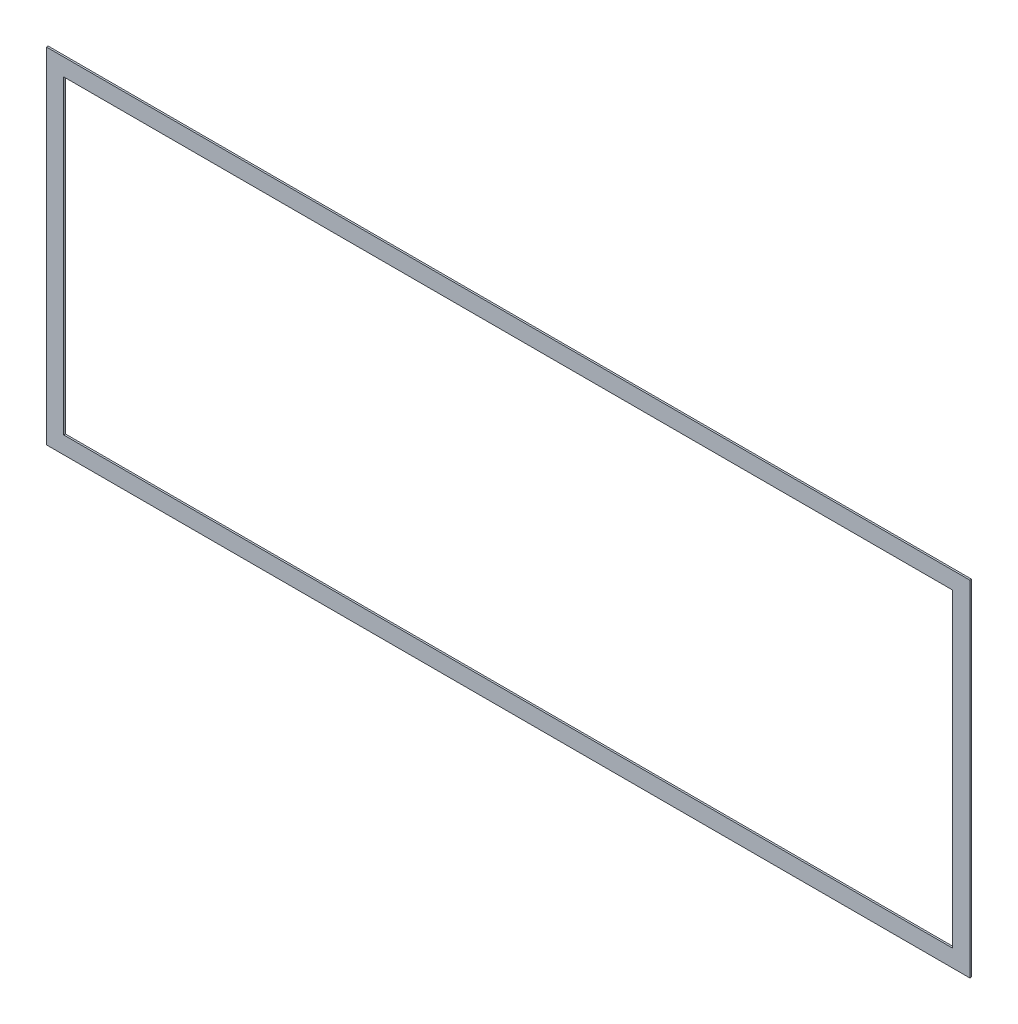
ISO-10303-21;
HEADER;
FILE_DESCRIPTION(('STEP AP214'),'2;1');
FILE_NAME('part.step','',(''),(''),'','','');
FILE_SCHEMA(('AUTOMOTIVE_DESIGN { 1 0 10303 214 1 1 1 1 }'));
ENDSEC;
DATA;
#1=APPLICATION_CONTEXT('core data for automotive mechanical design processes');
#2=APPLICATION_PROTOCOL_DEFINITION('international standard','automotive_design',2000,#1);
#3=PRODUCT_CONTEXT('',#1,'mechanical');
#4=PRODUCT('Part','Part','',(#3));
#5=PRODUCT_RELATED_PRODUCT_CATEGORY('part','',(#4));
#6=PRODUCT_DEFINITION_FORMATION('','',#4);
#7=PRODUCT_DEFINITION_CONTEXT('part definition',#1,'design');
#8=PRODUCT_DEFINITION('design','',#6,#7);
#9=PRODUCT_DEFINITION_SHAPE('','',#8);
#10=(LENGTH_UNIT() NAMED_UNIT(*) SI_UNIT(.MILLI.,.METRE.));
#11=(NAMED_UNIT(*) PLANE_ANGLE_UNIT() SI_UNIT($,.RADIAN.));
#12=(NAMED_UNIT(*) SI_UNIT($,.STERADIAN.) SOLID_ANGLE_UNIT());
#13=UNCERTAINTY_MEASURE_WITH_UNIT(LENGTH_MEASURE(1.E-05),#10,'distance_accuracy_value','');
#14=(GEOMETRIC_REPRESENTATION_CONTEXT(3) GLOBAL_UNCERTAINTY_ASSIGNED_CONTEXT((#13)) GLOBAL_UNIT_ASSIGNED_CONTEXT((#10,
#11,#12)) REPRESENTATION_CONTEXT('',''));
#15=CARTESIAN_POINT('',(0.,0.,0.));
#16=DIRECTION('',(0.,0.,1.));
#17=DIRECTION('',(1.,0.,0.));
#18=AXIS2_PLACEMENT_3D('',#15,#16,#17);
#19=CARTESIAN_POINT('',(0.,0.,0.));
#20=DIRECTION('',(0.,0.,1.));
#21=DIRECTION('',(1.,0.,0.));
#22=AXIS2_PLACEMENT_3D('',#19,#20,#21);
#23=PLANE('',#22);
#24=DIRECTION('',(0.,-1.,0.));
#25=VECTOR('',#24,1.);
#26=CARTESIAN_POINT('',(129.,45.,0.));
#27=LINE('',#26,#25);
#28=CARTESIAN_POINT('',(129.,45.,0.));
#29=VERTEX_POINT('',#28);
#30=CARTESIAN_POINT('',(129.,-45.,0.));
#31=VERTEX_POINT('',#30);
#32=EDGE_CURVE('E80',#29,#31,#27,.T.);
#33=ORIENTED_EDGE('',*,*,#32,.F.);
#34=DIRECTION('',(1.,0.,0.));
#35=VECTOR('',#34,1.);
#36=CARTESIAN_POINT('',(-129.,45.,0.));
#37=LINE('',#36,#35);
#38=CARTESIAN_POINT('',(-129.,45.,0.));
#39=VERTEX_POINT('',#38);
#40=EDGE_CURVE('E141',#39,#29,#37,.T.);
#41=ORIENTED_EDGE('',*,*,#40,.F.);
#42=DIRECTION('',(0.,1.,0.));
#43=VECTOR('',#42,1.);
#44=CARTESIAN_POINT('',(-129.,-45.,0.));
#45=LINE('',#44,#43);
#46=CARTESIAN_POINT('',(-129.,-45.,0.));
#47=VERTEX_POINT('',#46);
#48=EDGE_CURVE('E149',#47,#39,#45,.T.);
#49=ORIENTED_EDGE('',*,*,#48,.F.);
#50=DIRECTION('',(-1.,0.,0.));
#51=VECTOR('',#50,1.);
#52=CARTESIAN_POINT('',(129.,-45.,0.));
#53=LINE('',#52,#51);
#54=EDGE_CURVE('E129',#31,#47,#53,.T.);
#55=ORIENTED_EDGE('',*,*,#54,.F.);
#56=EDGE_LOOP('',(#33,#41,#49,#55));
#57=FACE_BOUND('',#56,.T.);
#58=DIRECTION('',(0.,1.,0.));
#59=VECTOR('',#58,1.);
#60=CARTESIAN_POINT('',(134.,-50.,0.));
#61=LINE('',#60,#59);
#62=CARTESIAN_POINT('',(134.,-50.,0.));
#63=VERTEX_POINT('',#62);
#64=CARTESIAN_POINT('',(134.,50.,0.));
#65=VERTEX_POINT('',#64);
#66=EDGE_CURVE('E27',#63,#65,#61,.T.);
#67=ORIENTED_EDGE('',*,*,#66,.F.);
#68=DIRECTION('',(1.,0.,0.));
#69=VECTOR('',#68,1.);
#70=CARTESIAN_POINT('',(-134.,-50.,0.));
#71=LINE('',#70,#69);
#72=CARTESIAN_POINT('',(-134.,-50.,0.));
#73=VERTEX_POINT('',#72);
#74=EDGE_CURVE('E118',#73,#63,#71,.T.);
#75=ORIENTED_EDGE('',*,*,#74,.F.);
#76=DIRECTION('',(0.,-1.,0.));
#77=VECTOR('',#76,1.);
#78=CARTESIAN_POINT('',(-134.,50.,0.));
#79=LINE('',#78,#77);
#80=CARTESIAN_POINT('',(-134.,50.,0.));
#81=VERTEX_POINT('',#80);
#82=EDGE_CURVE('E162',#81,#73,#79,.T.);
#83=ORIENTED_EDGE('',*,*,#82,.F.);
#84=DIRECTION('',(-1.,0.,0.));
#85=VECTOR('',#84,1.);
#86=CARTESIAN_POINT('',(134.,50.,0.));
#87=LINE('',#86,#85);
#88=EDGE_CURVE('E166',#65,#81,#87,.T.);
#89=ORIENTED_EDGE('',*,*,#88,.F.);
#90=EDGE_LOOP('',(#67,#75,#83,#89));
#91=FACE_BOUND('',#90,.T.);
#92=ADVANCED_FACE('F16',(#57,#91),#23,.F.);
#93=CARTESIAN_POINT('',(0.,0.,0.5));
#94=DIRECTION('',(0.,0.,1.));
#95=DIRECTION('',(1.,0.,0.));
#96=AXIS2_PLACEMENT_3D('',#93,#94,#95);
#97=PLANE('',#96);
#98=DIRECTION('',(0.,-1.,0.));
#99=VECTOR('',#98,1.);
#100=CARTESIAN_POINT('',(129.,45.,0.5));
#101=LINE('',#100,#99);
#102=CARTESIAN_POINT('',(129.,45.,0.5));
#103=VERTEX_POINT('',#102);
#104=CARTESIAN_POINT('',(129.,-45.,0.5));
#105=VERTEX_POINT('',#104);
#106=EDGE_CURVE('E20',#103,#105,#101,.T.);
#107=ORIENTED_EDGE('',*,*,#106,.T.);
#108=DIRECTION('',(-1.,0.,0.));
#109=VECTOR('',#108,1.);
#110=CARTESIAN_POINT('',(129.,-45.,0.5));
#111=LINE('',#110,#109);
#112=CARTESIAN_POINT('',(-129.,-45.,0.5));
#113=VERTEX_POINT('',#112);
#114=EDGE_CURVE('E112',#105,#113,#111,.T.);
#115=ORIENTED_EDGE('',*,*,#114,.T.);
#116=DIRECTION('',(0.,1.,0.));
#117=VECTOR('',#116,1.);
#118=CARTESIAN_POINT('',(-129.,-45.,0.5));
#119=LINE('',#118,#117);
#120=CARTESIAN_POINT('',(-129.,45.,0.5));
#121=VERTEX_POINT('',#120);
#122=EDGE_CURVE('E57',#113,#121,#119,.T.);
#123=ORIENTED_EDGE('',*,*,#122,.T.);
#124=DIRECTION('',(1.,0.,0.));
#125=VECTOR('',#124,1.);
#126=CARTESIAN_POINT('',(-129.,45.,0.5));
#127=LINE('',#126,#125);
#128=EDGE_CURVE('E115',#121,#103,#127,.T.);
#129=ORIENTED_EDGE('',*,*,#128,.T.);
#130=EDGE_LOOP('',(#107,#115,#123,#129));
#131=FACE_BOUND('',#130,.T.);
#132=DIRECTION('',(0.,1.,0.));
#133=VECTOR('',#132,1.);
#134=CARTESIAN_POINT('',(134.,-50.,0.5));
#135=LINE('',#134,#133);
#136=CARTESIAN_POINT('',(134.,-50.,0.5));
#137=VERTEX_POINT('',#136);
#138=CARTESIAN_POINT('',(134.,50.,0.5));
#139=VERTEX_POINT('',#138);
#140=EDGE_CURVE('E11',#137,#139,#135,.T.);
#141=ORIENTED_EDGE('',*,*,#140,.T.);
#142=DIRECTION('',(-1.,0.,0.));
#143=VECTOR('',#142,1.);
#144=CARTESIAN_POINT('',(134.,50.,0.5));
#145=LINE('',#144,#143);
#146=CARTESIAN_POINT('',(-134.,50.,0.5));
#147=VERTEX_POINT('',#146);
#148=EDGE_CURVE('E169',#139,#147,#145,.T.);
#149=ORIENTED_EDGE('',*,*,#148,.T.);
#150=DIRECTION('',(0.,-1.,0.));
#151=VECTOR('',#150,1.);
#152=CARTESIAN_POINT('',(-134.,50.,0.5));
#153=LINE('',#152,#151);
#154=CARTESIAN_POINT('',(-134.,-50.,0.5));
#155=VERTEX_POINT('',#154);
#156=EDGE_CURVE('E158',#147,#155,#153,.T.);
#157=ORIENTED_EDGE('',*,*,#156,.T.);
#158=DIRECTION('',(1.,0.,0.));
#159=VECTOR('',#158,1.);
#160=CARTESIAN_POINT('',(-134.,-50.,0.5));
#161=LINE('',#160,#159);
#162=EDGE_CURVE('E140',#155,#137,#161,.T.);
#163=ORIENTED_EDGE('',*,*,#162,.T.);
#164=EDGE_LOOP('',(#141,#149,#157,#163));
#165=FACE_BOUND('',#164,.T.);
#166=ADVANCED_FACE('F110',(#131,#165),#97,.T.);
#167=CARTESIAN_POINT('',(134.,-50.,0.));
#168=DIRECTION('',(1.,0.,0.));
#169=DIRECTION('',(0.,1.,0.));
#170=AXIS2_PLACEMENT_3D('',#167,#168,#169);
#171=PLANE('',#170);
#172=ORIENTED_EDGE('',*,*,#66,.T.);
#173=DIRECTION('',(0.,0.,1.));
#174=VECTOR('',#173,1.);
#175=CARTESIAN_POINT('',(134.,50.,0.));
#176=LINE('',#175,#174);
#177=EDGE_CURVE('E154',#65,#139,#176,.T.);
#178=ORIENTED_EDGE('',*,*,#177,.T.);
#179=ORIENTED_EDGE('',*,*,#140,.F.);
#180=DIRECTION('',(0.,0.,1.));
#181=VECTOR('',#180,1.);
#182=CARTESIAN_POINT('',(134.,-50.,0.));
#183=LINE('',#182,#181);
#184=EDGE_CURVE('E137',#63,#137,#183,.T.);
#185=ORIENTED_EDGE('',*,*,#184,.F.);
#186=EDGE_LOOP('',(#172,#178,#179,#185));
#187=FACE_BOUND('',#186,.T.);
#188=ADVANCED_FACE('F213',(#187),#171,.T.);
#189=CARTESIAN_POINT('',(134.,50.,0.));
#190=DIRECTION('',(0.,1.,0.));
#191=DIRECTION('',(1.,0.,0.));
#192=AXIS2_PLACEMENT_3D('',#189,#190,#191);
#193=PLANE('',#192);
#194=ORIENTED_EDGE('',*,*,#88,.T.);
#195=DIRECTION('',(0.,0.,1.));
#196=VECTOR('',#195,1.);
#197=CARTESIAN_POINT('',(-134.,50.,0.));
#198=LINE('',#197,#196);
#199=EDGE_CURVE('E161',#81,#147,#198,.T.);
#200=ORIENTED_EDGE('',*,*,#199,.T.);
#201=ORIENTED_EDGE('',*,*,#148,.F.);
#202=ORIENTED_EDGE('',*,*,#177,.F.);
#203=EDGE_LOOP('',(#194,#200,#201,#202));
#204=FACE_BOUND('',#203,.T.);
#205=ADVANCED_FACE('F203',(#204),#193,.T.);
#206=CARTESIAN_POINT('',(-134.,50.,0.));
#207=DIRECTION('',(-1.,0.,0.));
#208=DIRECTION('',(0.,0.,1.));
#209=AXIS2_PLACEMENT_3D('',#206,#207,#208);
#210=PLANE('',#209);
#211=ORIENTED_EDGE('',*,*,#82,.T.);
#212=DIRECTION('',(0.,0.,1.));
#213=VECTOR('',#212,1.);
#214=CARTESIAN_POINT('',(-134.,-50.,0.));
#215=LINE('',#214,#213);
#216=EDGE_CURVE('E174',#73,#155,#215,.T.);
#217=ORIENTED_EDGE('',*,*,#216,.T.);
#218=ORIENTED_EDGE('',*,*,#156,.F.);
#219=ORIENTED_EDGE('',*,*,#199,.F.);
#220=EDGE_LOOP('',(#211,#217,#218,#219));
#221=FACE_BOUND('',#220,.T.);
#222=ADVANCED_FACE('F18',(#221),#210,.T.);
#223=CARTESIAN_POINT('',(-134.,-50.,0.));
#224=DIRECTION('',(0.,-1.,0.));
#225=DIRECTION('',(0.,0.,-1.));
#226=AXIS2_PLACEMENT_3D('',#223,#224,#225);
#227=PLANE('',#226);
#228=ORIENTED_EDGE('',*,*,#74,.T.);
#229=ORIENTED_EDGE('',*,*,#184,.T.);
#230=ORIENTED_EDGE('',*,*,#162,.F.);
#231=ORIENTED_EDGE('',*,*,#216,.F.);
#232=EDGE_LOOP('',(#228,#229,#230,#231));
#233=FACE_BOUND('',#232,.T.);
#234=ADVANCED_FACE('F210',(#233),#227,.T.);
#235=CARTESIAN_POINT('',(129.,45.,0.));
#236=DIRECTION('',(-1.,0.,0.));
#237=DIRECTION('',(0.,0.,1.));
#238=AXIS2_PLACEMENT_3D('',#235,#236,#237);
#239=PLANE('',#238);
#240=ORIENTED_EDGE('',*,*,#32,.T.);
#241=DIRECTION('',(0.,0.,1.));
#242=VECTOR('',#241,1.);
#243=CARTESIAN_POINT('',(129.,-45.,0.));
#244=LINE('',#243,#242);
#245=EDGE_CURVE('E120',#31,#105,#244,.T.);
#246=ORIENTED_EDGE('',*,*,#245,.T.);
#247=ORIENTED_EDGE('',*,*,#106,.F.);
#248=DIRECTION('',(0.,0.,1.));
#249=VECTOR('',#248,1.);
#250=CARTESIAN_POINT('',(129.,45.,0.));
#251=LINE('',#250,#249);
#252=EDGE_CURVE('E145',#29,#103,#251,.T.);
#253=ORIENTED_EDGE('',*,*,#252,.F.);
#254=EDGE_LOOP('',(#240,#246,#247,#253));
#255=FACE_BOUND('',#254,.T.);
#256=ADVANCED_FACE('F121',(#255),#239,.T.);
#257=CARTESIAN_POINT('',(129.,-45.,0.));
#258=DIRECTION('',(0.,1.,0.));
#259=DIRECTION('',(1.,0.,0.));
#260=AXIS2_PLACEMENT_3D('',#257,#258,#259);
#261=PLANE('',#260);
#262=ORIENTED_EDGE('',*,*,#54,.T.);
#263=DIRECTION('',(0.,0.,1.));
#264=VECTOR('',#263,1.);
#265=CARTESIAN_POINT('',(-129.,-45.,0.));
#266=LINE('',#265,#264);
#267=EDGE_CURVE('E127',#47,#113,#266,.T.);
#268=ORIENTED_EDGE('',*,*,#267,.T.);
#269=ORIENTED_EDGE('',*,*,#114,.F.);
#270=ORIENTED_EDGE('',*,*,#245,.F.);
#271=EDGE_LOOP('',(#262,#268,#269,#270));
#272=FACE_BOUND('',#271,.T.);
#273=ADVANCED_FACE('F125',(#272),#261,.T.);
#274=CARTESIAN_POINT('',(-129.,-45.,0.));
#275=DIRECTION('',(1.,0.,0.));
#276=DIRECTION('',(0.,1.,0.));
#277=AXIS2_PLACEMENT_3D('',#274,#275,#276);
#278=PLANE('',#277);
#279=ORIENTED_EDGE('',*,*,#48,.T.);
#280=DIRECTION('',(0.,0.,1.));
#281=VECTOR('',#280,1.);
#282=CARTESIAN_POINT('',(-129.,45.,0.));
#283=LINE('',#282,#281);
#284=EDGE_CURVE('E146',#39,#121,#283,.T.);
#285=ORIENTED_EDGE('',*,*,#284,.T.);
#286=ORIENTED_EDGE('',*,*,#122,.F.);
#287=ORIENTED_EDGE('',*,*,#267,.F.);
#288=EDGE_LOOP('',(#279,#285,#286,#287));
#289=FACE_BOUND('',#288,.T.);
#290=ADVANCED_FACE('F230',(#289),#278,.T.);
#291=CARTESIAN_POINT('',(-129.,45.,0.));
#292=DIRECTION('',(0.,-1.,0.));
#293=DIRECTION('',(0.,0.,-1.));
#294=AXIS2_PLACEMENT_3D('',#291,#292,#293);
#295=PLANE('',#294);
#296=ORIENTED_EDGE('',*,*,#40,.T.);
#297=ORIENTED_EDGE('',*,*,#252,.T.);
#298=ORIENTED_EDGE('',*,*,#128,.F.);
#299=ORIENTED_EDGE('',*,*,#284,.F.);
#300=EDGE_LOOP('',(#296,#297,#298,#299));
#301=FACE_BOUND('',#300,.T.);
#302=ADVANCED_FACE('F233',(#301),#295,.T.);
#303=CLOSED_SHELL('',(#92,#166,#188,#205,#222,#234,#256,#273,#290,#302));
#304=MANIFOLD_SOLID_BREP('B1',#303);
#305=ADVANCED_BREP_SHAPE_REPRESENTATION('',(#18,#304),#14);
#306=SHAPE_DEFINITION_REPRESENTATION(#9,#305);
ENDSEC;
END-ISO-10303-21;
